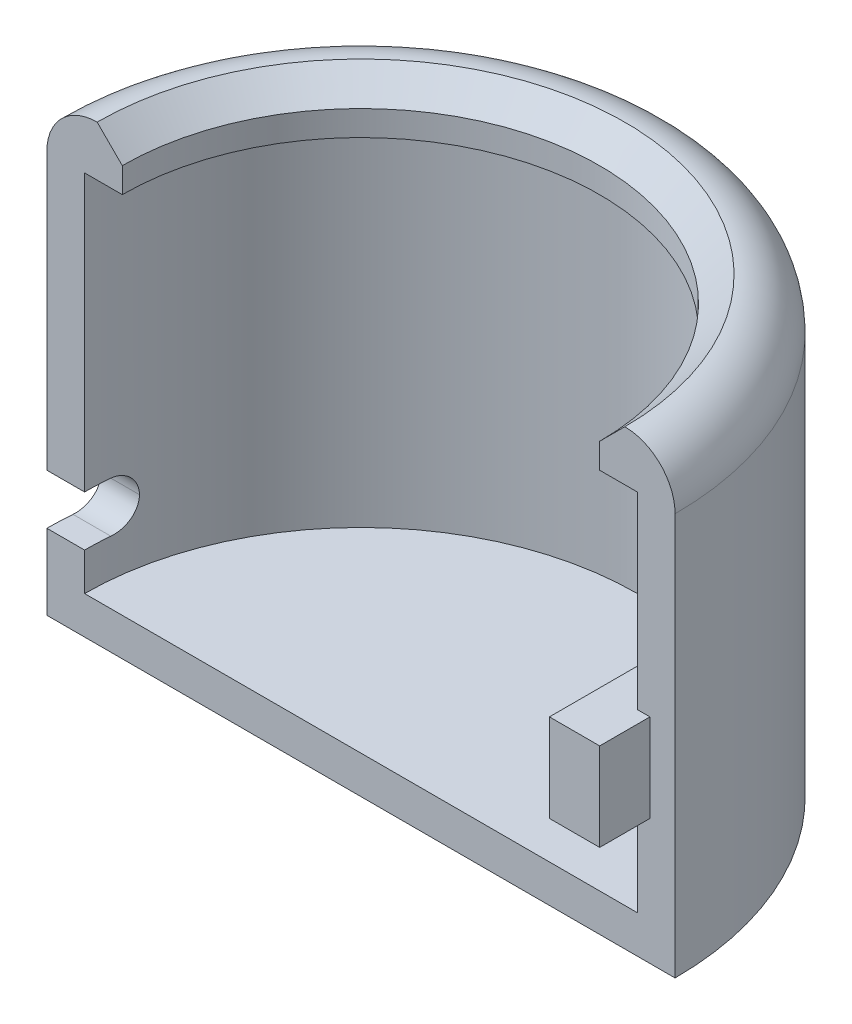
ISO-10303-21;
HEADER;
FILE_DESCRIPTION(('STEP AP214'),'2;1');
FILE_NAME('part.step','',(''),(''),'','','');
FILE_SCHEMA(('AUTOMOTIVE_DESIGN { 1 0 10303 214 1 1 1 1 }'));
ENDSEC;
DATA;
#1=APPLICATION_CONTEXT('core data for automotive mechanical design processes');
#2=APPLICATION_PROTOCOL_DEFINITION('international standard','automotive_design',2000,#1);
#3=PRODUCT_CONTEXT('',#1,'mechanical');
#4=PRODUCT('Part','Part','',(#3));
#5=PRODUCT_RELATED_PRODUCT_CATEGORY('part','',(#4));
#6=PRODUCT_DEFINITION_FORMATION('','',#4);
#7=PRODUCT_DEFINITION_CONTEXT('part definition',#1,'design');
#8=PRODUCT_DEFINITION('design','',#6,#7);
#9=PRODUCT_DEFINITION_SHAPE('','',#8);
#10=(LENGTH_UNIT() NAMED_UNIT(*) SI_UNIT(.MILLI.,.METRE.));
#11=(NAMED_UNIT(*) PLANE_ANGLE_UNIT() SI_UNIT($,.RADIAN.));
#12=(NAMED_UNIT(*) SI_UNIT($,.STERADIAN.) SOLID_ANGLE_UNIT());
#13=UNCERTAINTY_MEASURE_WITH_UNIT(LENGTH_MEASURE(1.E-05),#10,'distance_accuracy_value','');
#14=(GEOMETRIC_REPRESENTATION_CONTEXT(3) GLOBAL_UNCERTAINTY_ASSIGNED_CONTEXT((#13)) GLOBAL_UNIT_ASSIGNED_CONTEXT((#10,
#11,#12)) REPRESENTATION_CONTEXT('',''));
#15=CARTESIAN_POINT('',(0.,0.,0.));
#16=DIRECTION('',(0.,0.,1.));
#17=DIRECTION('',(1.,0.,0.));
#18=AXIS2_PLACEMENT_3D('',#15,#16,#17);
#19=CARTESIAN_POINT('',(0.,0.,0.));
#20=DIRECTION('',(0.,-1.,0.));
#21=DIRECTION('',(0.,0.,-1.));
#22=AXIS2_PLACEMENT_3D('',#19,#20,#21);
#23=CYLINDRICAL_SURFACE('',#22,11.);
#24=DIRECTION('',(0.,-1.,0.));
#25=VECTOR('',#24,1.);
#26=CARTESIAN_POINT('',(11.,16.,0.));
#27=LINE('',#26,#25);
#28=CARTESIAN_POINT('',(11.,5.,0.));
#29=VERTEX_POINT('',#28);
#30=CARTESIAN_POINT('',(11.,1.5,0.));
#31=VERTEX_POINT('',#30);
#32=EDGE_CURVE('E228',#29,#31,#27,.T.);
#33=ORIENTED_EDGE('',*,*,#32,.F.);
#34=CARTESIAN_POINT('',(0.,5.,0.));
#35=DIRECTION('',(0.,-1.,0.));
#36=DIRECTION('',(0.,0.,-1.));
#37=AXIS2_PLACEMENT_3D('',#34,#35,#36);
#38=CIRCLE('',#37,11.);
#39=CARTESIAN_POINT('',(9.5,5.,-5.54526825320471));
#40=VERTEX_POINT('',#39);
#41=EDGE_CURVE('E59',#29,#40,#38,.F.);
#42=ORIENTED_EDGE('',*,*,#41,.T.);
#43=DIRECTION('',(0.,-1.,0.));
#44=VECTOR('',#43,1.);
#45=CARTESIAN_POINT('',(9.5,0.,-5.54526825320471));
#46=LINE('',#45,#44);
#47=CARTESIAN_POINT('',(9.5,8.5,-5.54526825320471));
#48=VERTEX_POINT('',#47);
#49=EDGE_CURVE('E64',#40,#48,#46,.F.);
#50=ORIENTED_EDGE('',*,*,#49,.T.);
#51=CARTESIAN_POINT('',(0.,8.5,0.));
#52=DIRECTION('',(0.,1.,0.));
#53=DIRECTION('',(0.,0.,1.));
#54=AXIS2_PLACEMENT_3D('',#51,#52,#53);
#55=CIRCLE('',#54,11.);
#56=CARTESIAN_POINT('',(11.,8.5,0.));
#57=VERTEX_POINT('',#56);
#58=EDGE_CURVE('E387',#48,#57,#55,.F.);
#59=ORIENTED_EDGE('',*,*,#58,.T.);
#60=CARTESIAN_POINT('',(11.,16.,0.));
#61=VERTEX_POINT('',#60);
#62=EDGE_CURVE('E229',#61,#57,#27,.T.);
#63=ORIENTED_EDGE('',*,*,#62,.F.);
#64=CARTESIAN_POINT('',(0.,16.,0.));
#65=DIRECTION('',(0.,-1.,0.));
#66=DIRECTION('',(0.,0.,-1.));
#67=AXIS2_PLACEMENT_3D('',#64,#65,#66);
#68=CIRCLE('',#67,11.);
#69=CARTESIAN_POINT('',(-11.,16.,0.));
#70=VERTEX_POINT('',#69);
#71=EDGE_CURVE('E261',#70,#61,#68,.T.);
#72=ORIENTED_EDGE('',*,*,#71,.F.);
#73=DIRECTION('',(0.,-1.,0.));
#74=VECTOR('',#73,1.);
#75=CARTESIAN_POINT('',(-11.,16.,0.));
#76=LINE('',#75,#74);
#77=CARTESIAN_POINT('',(-11.,5.,0.));
#78=VERTEX_POINT('',#77);
#79=EDGE_CURVE('E249',#70,#78,#76,.T.);
#80=ORIENTED_EDGE('',*,*,#79,.T.);
#81=CARTESIAN_POINT('',(0.,5.,0.));
#82=DIRECTION('',(0.,1.,0.));
#83=DIRECTION('',(0.,0.,1.));
#84=AXIS2_PLACEMENT_3D('',#81,#82,#83);
#85=CIRCLE('',#84,11.);
#86=CARTESIAN_POINT('',(-10.9544511501033,5.,-1.));
#87=VERTEX_POINT('',#86);
#88=EDGE_CURVE('E199',#78,#87,#85,.F.);
#89=ORIENTED_EDGE('',*,*,#88,.T.);
#90=CARTESIAN_POINT('',(-10.9544511501033,5.,-1.));
#91=CARTESIAN_POINT('',(-10.9518675809151,4.9999998199935,-1.02830839869906));
#92=CARTESIAN_POINT('',(-10.9491741852321,4.99879723433273,-1.0565926700534));
#93=CARTESIAN_POINT('',(-10.9435904837359,4.99400481074643,-1.11293611508523));
#94=CARTESIAN_POINT('',(-10.9407001956144,4.9904151870564,-1.14099530873464));
#95=CARTESIAN_POINT('',(-10.931778195905,4.97610912130699,-1.2244764232659));
#96=CARTESIAN_POINT('',(-10.9254857941944,4.9618553414229,-1.27930602995323));
#97=CARTESIAN_POINT('',(-10.9124996642088,4.92434018108407,-1.38572513755939));
#98=CARTESIAN_POINT('',(-10.9058058227038,4.90107624903445,-1.43731371583379));
#99=CARTESIAN_POINT('',(-10.8923676977008,4.84620040831363,-1.53583801077365));
#100=CARTESIAN_POINT('',(-10.8856234176689,4.81458906821104,-1.58277404403944));
#101=CARTESIAN_POINT('',(-10.872454094253,4.74375276313902,-1.67084902051204));
#102=CARTESIAN_POINT('',(-10.8660303586156,4.70449937740766,-1.71196530253926));
#103=CARTESIAN_POINT('',(-10.8539397225827,4.61952570109758,-1.78702021815186));
#104=CARTESIAN_POINT('',(-10.8482729426689,4.57380438342226,-1.82095770961758));
#105=CARTESIAN_POINT('',(-10.8381124738057,4.47742748619328,-1.88048627289487));
#106=CARTESIAN_POINT('',(-10.8336129715715,4.42679815366631,-1.9061188703052));
#107=CARTESIAN_POINT('',(-10.8260756758648,4.32185700115901,-1.9484742029149));
#108=CARTESIAN_POINT('',(-10.8230367471214,4.2675480788292,-1.96520385925963));
#109=CARTESIAN_POINT('',(-10.81945781636,4.17737900302397,-1.98478988213805));
#110=CARTESIAN_POINT('',(-10.8184092027135,4.1421310142209,-1.99048930336897));
#111=CARTESIAN_POINT('',(-10.8170062697717,4.07126090112556,-1.99809408407323));
#112=CARTESIAN_POINT('',(-10.8166510526255,4.03563932078584,-2.00000435002126));
#113=CARTESIAN_POINT('',(-10.816653826392,4.,-2.));
#114=B_SPLINE_CURVE_WITH_KNOTS('',3,(#90,#91,#92,#93,#94,#95,#96,#97,#98,#99,#100,#101,#102,
#103,#104,#105,#106,#107,#108,#109,#110,#111,#112,#113),.UNSPECIFIED.,.F.,.F.,(4,2,2,2,2,2,2,2,
2,2,2,4),(0.,0.0852248659012835,0.17044208394473,0.340566766933351,0.510739662986263,
0.680900971008499,0.851707633267387,1.02254144984461,1.19250739665715,1.36234101822398,
1.46931029164489,1.57614096279052),.UNSPECIFIED.);
#115=CARTESIAN_POINT('',(-10.816653826392,4.,-2.));
#116=VERTEX_POINT('',#115);
#117=EDGE_CURVE('E303',#87,#116,#114,.T.);
#118=ORIENTED_EDGE('',*,*,#117,.T.);
#119=CARTESIAN_POINT('',(-10.816653826392,4.,-2.));
#120=CARTESIAN_POINT('',(-10.8166531832004,3.9721570117737,-2.00000007570774));
#121=CARTESIAN_POINT('',(-10.8168690435344,3.94432753902859,-1.99883640879706));
#122=CARTESIAN_POINT('',(-10.8177257927322,3.88887141558756,-1.99419580647937));
#123=CARTESIAN_POINT('',(-10.8183666407221,3.86124474564511,-1.99071909353292));
#124=CARTESIAN_POINT('',(-10.8209109706457,3.77904707553457,-1.9768610305933));
#125=CARTESIAN_POINT('',(-10.823436310885,3.72503253307554,-1.96305160794933));
#126=CARTESIAN_POINT('',(-10.8299643008146,3.62013716143522,-1.92670956043359));
#127=CARTESIAN_POINT('',(-10.8339673178462,3.56925711514355,-1.90417476641987));
#128=CARTESIAN_POINT('',(-10.8431697198825,3.47200510226195,-1.85105224574431));
#129=CARTESIAN_POINT('',(-10.8483691232962,3.42563320505515,-1.82046439516792));
#130=CARTESIAN_POINT('',(-10.8596696193382,3.33824654516375,-1.75179735112358));
#131=CARTESIAN_POINT('',(-10.8657785276165,3.29728468648399,-1.7136521684561));
#132=CARTESIAN_POINT('',(-10.8784749534925,3.22230588948367,-1.63111098440458));
#133=CARTESIAN_POINT('',(-10.8850625858119,3.1882906233389,-1.5867134823048));
#134=CARTESIAN_POINT('',(-10.8984139674121,3.12772849810608,-1.49227167189927));
#135=CARTESIAN_POINT('',(-10.9051788935598,3.10128597728028,-1.44216065334069));
#136=CARTESIAN_POINT('',(-10.918425731274,3.05722763815222,-1.338177670493));
#137=CARTESIAN_POINT('',(-10.9249078027614,3.03960677164119,-1.28430787732711));
#138=CARTESIAN_POINT('',(-10.9353115438696,3.01780763132853,-1.19180120168974));
#139=CARTESIAN_POINT('',(-10.9393933415288,3.01113855027786,-1.15375054794585));
#140=CARTESIAN_POINT('',(-10.9472030857999,3.00223439580666,-1.07714541315814));
#141=CARTESIAN_POINT('',(-10.9509314519239,2.99999400130974,-1.0385915928299));
#142=CARTESIAN_POINT('',(-10.9544511501033,3.,-1.));
#143=B_SPLINE_CURVE_WITH_KNOTS('',3,(#119,#120,#121,#122,#123,#124,#125,#126,#127,#128,#129,
#130,#131,#132,#133,#134,#135,#136,#137,#138,#139,#140,#141,#142),.UNSPECIFIED.,.F.,.F.,(4,2,2,
2,2,2,2,2,2,2,2,4),(0.,0.08347707527952,0.166946123190975,0.333511431406912,0.50011817465156,
0.666727481668638,0.834861367282832,1.00303567831007,1.1734264419907,1.34371958745275,
1.46001415118683,1.57616890161781),.UNSPECIFIED.);
#144=CARTESIAN_POINT('',(-10.9544511501033,3.,-1.));
#145=VERTEX_POINT('',#144);
#146=EDGE_CURVE('E52',#116,#145,#143,.T.);
#147=ORIENTED_EDGE('',*,*,#146,.T.);
#148=CARTESIAN_POINT('',(0.,3.,0.));
#149=DIRECTION('',(0.,-1.,0.));
#150=DIRECTION('',(0.,0.,-1.));
#151=AXIS2_PLACEMENT_3D('',#148,#149,#150);
#152=CIRCLE('',#151,11.);
#153=CARTESIAN_POINT('',(-11.,3.,0.));
#154=VERTEX_POINT('',#153);
#155=EDGE_CURVE('E210',#145,#154,#152,.F.);
#156=ORIENTED_EDGE('',*,*,#155,.T.);
#157=CARTESIAN_POINT('',(-11.,1.5,0.));
#158=VERTEX_POINT('',#157);
#159=EDGE_CURVE('E248',#154,#158,#76,.T.);
#160=ORIENTED_EDGE('',*,*,#159,.T.);
#161=CARTESIAN_POINT('',(0.,1.5,0.));
#162=DIRECTION('',(0.,-1.,0.));
#163=DIRECTION('',(0.,0.,-1.));
#164=AXIS2_PLACEMENT_3D('',#161,#162,#163);
#165=CIRCLE('',#164,11.);
#166=EDGE_CURVE('E257',#158,#31,#165,.T.);
#167=ORIENTED_EDGE('',*,*,#166,.T.);
#168=EDGE_LOOP('',(#33,#42,#50,#59,#63,#72,#80,#89,#118,#147,#156,#160,#167));
#169=FACE_BOUND('',#168,.T.);
#170=ADVANCED_FACE('F41',(#169),#23,.F.);
#171=CARTESIAN_POINT('',(0.,0.,0.));
#172=DIRECTION('',(0.,0.,-1.));
#173=DIRECTION('',(-1.,0.,0.));
#174=AXIS2_PLACEMENT_3D('',#171,#172,#173);
#175=PLANE('',#174);
#176=DIRECTION('',(1.,0.,0.));
#177=VECTOR('',#176,1.);
#178=CARTESIAN_POINT('',(9.5,5.,0.));
#179=LINE('',#178,#177);
#180=CARTESIAN_POINT('',(11.5,5.,0.));
#181=VERTEX_POINT('',#180);
#182=EDGE_CURVE('E400',#29,#181,#179,.T.);
#183=ORIENTED_EDGE('',*,*,#182,.F.);
#184=ORIENTED_EDGE('',*,*,#32,.T.);
#185=DIRECTION('',(1.,0.,0.));
#186=VECTOR('',#185,1.);
#187=CARTESIAN_POINT('',(-11.,1.5,0.));
#188=LINE('',#187,#186);
#189=EDGE_CURVE('E253',#158,#31,#188,.T.);
#190=ORIENTED_EDGE('',*,*,#189,.F.);
#191=ORIENTED_EDGE('',*,*,#159,.F.);
#192=DIRECTION('',(1.,0.,0.));
#193=VECTOR('',#192,1.);
#194=CARTESIAN_POINT('',(-12.501,3.,0.));
#195=LINE('',#194,#193);
#196=CARTESIAN_POINT('',(-12.5,3.,0.));
#197=VERTEX_POINT('',#196);
#198=EDGE_CURVE('E206',#197,#154,#195,.T.);
#199=ORIENTED_EDGE('',*,*,#198,.F.);
#200=DIRECTION('',(0.,1.,0.));
#201=VECTOR('',#200,1.);
#202=CARTESIAN_POINT('',(-12.5,0.,0.));
#203=LINE('',#202,#201);
#204=CARTESIAN_POINT('',(-12.5,0.,0.));
#205=VERTEX_POINT('',#204);
#206=EDGE_CURVE('E237',#205,#197,#203,.T.);
#207=ORIENTED_EDGE('',*,*,#206,.F.);
#208=DIRECTION('',(-1.,0.,0.));
#209=VECTOR('',#208,1.);
#210=CARTESIAN_POINT('',(0.,0.,0.));
#211=LINE('',#210,#209);
#212=CARTESIAN_POINT('',(12.5,0.,0.));
#213=VERTEX_POINT('',#212);
#214=EDGE_CURVE('E232',#213,#205,#211,.T.);
#215=ORIENTED_EDGE('',*,*,#214,.F.);
#216=DIRECTION('',(0.,1.,0.));
#217=VECTOR('',#216,1.);
#218=CARTESIAN_POINT('',(12.5,0.,0.));
#219=LINE('',#218,#217);
#220=CARTESIAN_POINT('',(12.5,16.,0.));
#221=VERTEX_POINT('',#220);
#222=EDGE_CURVE('E217',#213,#221,#219,.T.);
#223=ORIENTED_EDGE('',*,*,#222,.T.);
#224=CARTESIAN_POINT('',(10.5,16.,0.));
#225=DIRECTION('',(0.,0.,-1.));
#226=DIRECTION('',(-1.,0.,0.));
#227=AXIS2_PLACEMENT_3D('',#224,#225,#226);
#228=CIRCLE('',#227,2.);
#229=CARTESIAN_POINT('',(10.5,18.,0.));
#230=VERTEX_POINT('',#229);
#231=EDGE_CURVE('E293',#221,#230,#228,.F.);
#232=ORIENTED_EDGE('',*,*,#231,.T.);
#233=DIRECTION('',(-0.707106781186545,-0.70710678118655,0.));
#234=VECTOR('',#233,1.);
#235=CARTESIAN_POINT('',(0.,7.49999999999992,0.));
#236=LINE('',#235,#234);
#237=CARTESIAN_POINT('',(9.5,17.,0.));
#238=VERTEX_POINT('',#237);
#239=EDGE_CURVE('E279',#230,#238,#236,.T.);
#240=ORIENTED_EDGE('',*,*,#239,.T.);
#241=DIRECTION('',(0.,-1.,0.));
#242=VECTOR('',#241,1.);
#243=CARTESIAN_POINT('',(9.5,18.,0.));
#244=LINE('',#243,#242);
#245=CARTESIAN_POINT('',(9.5,16.,0.));
#246=VERTEX_POINT('',#245);
#247=EDGE_CURVE('E221',#238,#246,#244,.T.);
#248=ORIENTED_EDGE('',*,*,#247,.T.);
#249=DIRECTION('',(1.,0.,0.));
#250=VECTOR('',#249,1.);
#251=CARTESIAN_POINT('',(9.5,16.,0.));
#252=LINE('',#251,#250);
#253=EDGE_CURVE('E224',#246,#61,#252,.T.);
#254=ORIENTED_EDGE('',*,*,#253,.T.);
#255=ORIENTED_EDGE('',*,*,#62,.T.);
#256=DIRECTION('',(-1.,0.,0.));
#257=VECTOR('',#256,1.);
#258=CARTESIAN_POINT('',(9.5,8.5,0.));
#259=LINE('',#258,#257);
#260=CARTESIAN_POINT('',(11.5,8.5,0.));
#261=VERTEX_POINT('',#260);
#262=EDGE_CURVE('E183',#261,#57,#259,.T.);
#263=ORIENTED_EDGE('',*,*,#262,.F.);
#264=DIRECTION('',(0.,1.,0.));
#265=VECTOR('',#264,1.);
#266=CARTESIAN_POINT('',(11.5,8.5,0.));
#267=LINE('',#266,#265);
#268=EDGE_CURVE('E397',#181,#261,#267,.T.);
#269=ORIENTED_EDGE('',*,*,#268,.F.);
#270=EDGE_LOOP('',(#183,#184,#190,#191,#199,#207,#215,#223,#232,#240,#248,#254,#255,#263,#269));
#271=FACE_BOUND('',#270,.T.);
#272=ADVANCED_FACE('F325',(#271),#175,.F.);
#273=CARTESIAN_POINT('',(-12.5,5.,0.));
#274=VERTEX_POINT('',#273);
#275=CARTESIAN_POINT('',(-12.5,16.,0.));
#276=VERTEX_POINT('',#275);
#277=EDGE_CURVE('E236',#274,#276,#203,.T.);
#278=ORIENTED_EDGE('',*,*,#277,.F.);
#279=DIRECTION('',(-1.,0.,0.));
#280=VECTOR('',#279,1.);
#281=CARTESIAN_POINT('',(-12.501,5.,0.));
#282=LINE('',#281,#280);
#283=EDGE_CURVE('E191',#78,#274,#282,.T.);
#284=ORIENTED_EDGE('',*,*,#283,.F.);
#285=ORIENTED_EDGE('',*,*,#79,.F.);
#286=DIRECTION('',(-1.,0.,0.));
#287=VECTOR('',#286,1.);
#288=CARTESIAN_POINT('',(-9.5,16.,0.));
#289=LINE('',#288,#287);
#290=CARTESIAN_POINT('',(-9.5,16.,0.));
#291=VERTEX_POINT('',#290);
#292=EDGE_CURVE('E244',#291,#70,#289,.T.);
#293=ORIENTED_EDGE('',*,*,#292,.F.);
#294=DIRECTION('',(0.,-1.,0.));
#295=VECTOR('',#294,1.);
#296=CARTESIAN_POINT('',(-9.5,18.,0.));
#297=LINE('',#296,#295);
#298=CARTESIAN_POINT('',(-9.5,17.,0.));
#299=VERTEX_POINT('',#298);
#300=EDGE_CURVE('E241',#299,#291,#297,.T.);
#301=ORIENTED_EDGE('',*,*,#300,.F.);
#302=DIRECTION('',(-0.707106781186545,0.70710678118655,0.));
#303=VECTOR('',#302,1.);
#304=CARTESIAN_POINT('',(0.,7.49999999999992,0.));
#305=LINE('',#304,#303);
#306=CARTESIAN_POINT('',(-10.5,18.,0.));
#307=VERTEX_POINT('',#306);
#308=EDGE_CURVE('E276',#299,#307,#305,.T.);
#309=ORIENTED_EDGE('',*,*,#308,.T.);
#310=CARTESIAN_POINT('',(-10.5,16.,0.));
#311=DIRECTION('',(0.,0.,-1.));
#312=DIRECTION('',(-1.,0.,0.));
#313=AXIS2_PLACEMENT_3D('',#310,#311,#312);
#314=CIRCLE('',#313,2.);
#315=EDGE_CURVE('E289',#307,#276,#314,.F.);
#316=ORIENTED_EDGE('',*,*,#315,.T.);
#317=EDGE_LOOP('',(#278,#284,#285,#293,#301,#309,#316));
#318=FACE_BOUND('',#317,.T.);
#319=ADVANCED_FACE('F350',(#318),#175,.F.);
#320=CARTESIAN_POINT('',(0.,0.,0.));
#321=DIRECTION('',(0.,-1.,0.));
#322=DIRECTION('',(0.,0.,-1.));
#323=AXIS2_PLACEMENT_3D('',#320,#321,#322);
#324=PLANE('',#323);
#325=CARTESIAN_POINT('',(0.,0.,0.));
#326=DIRECTION('',(0.,-1.,0.));
#327=DIRECTION('',(0.,0.,-1.));
#328=AXIS2_PLACEMENT_3D('',#325,#326,#327);
#329=CIRCLE('',#328,12.5);
#330=EDGE_CURVE('E268',#205,#213,#329,.T.);
#331=ORIENTED_EDGE('',*,*,#330,.T.);
#332=ORIENTED_EDGE('',*,*,#214,.T.);
#333=EDGE_LOOP('',(#331,#332));
#334=FACE_BOUND('',#333,.T.);
#335=ADVANCED_FACE('F345',(#334),#324,.T.);
#336=CARTESIAN_POINT('',(0.,0.,0.));
#337=DIRECTION('',(0.,-1.,0.));
#338=DIRECTION('',(0.,0.,-1.));
#339=AXIS2_PLACEMENT_3D('',#336,#337,#338);
#340=CYLINDRICAL_SURFACE('',#339,12.5);
#341=CARTESIAN_POINT('',(0.,3.,0.));
#342=DIRECTION('',(0.,-1.,0.));
#343=DIRECTION('',(0.,0.,-1.));
#344=AXIS2_PLACEMENT_3D('',#341,#342,#343);
#345=CIRCLE('',#344,12.5);
#346=CARTESIAN_POINT('',(-12.4599357943771,3.,-1.));
#347=VERTEX_POINT('',#346);
#348=EDGE_CURVE('E213',#197,#347,#345,.T.);
#349=ORIENTED_EDGE('',*,*,#348,.T.);
#350=CARTESIAN_POINT('',(-12.4599357943771,3.,-1.));
#351=CARTESIAN_POINT('',(-12.4576675349942,3.00000018161219,-1.0282691453316));
#352=CARTESIAN_POINT('',(-12.4553029808142,3.0011994407034,-1.05651660374712));
#353=CARTESIAN_POINT('',(-12.450401198586,3.00597978592114,-1.11279188711486));
#354=CARTESIAN_POINT('',(-12.4478639844011,3.0095606810219,-1.14081972949958));
#355=CARTESIAN_POINT('',(-12.4400319452468,3.02383468103815,-1.22421731767831));
#356=CARTESIAN_POINT('',(-12.4345085160692,3.03805923170597,-1.27900288979199));
#357=CARTESIAN_POINT('',(-12.4231099874704,3.07550795639682,-1.38535488246229));
#358=CARTESIAN_POINT('',(-12.4172347731823,3.09873508369665,-1.43692024018204));
#359=CARTESIAN_POINT('',(-12.4054416865245,3.15352970341988,-1.53540770143641));
#360=CARTESIAN_POINT('',(-12.3995238181771,3.18509641916666,-1.58233023680401));
#361=CARTESIAN_POINT('',(-12.38797519854,3.25579928955282,-1.67034443770372));
#362=CARTESIAN_POINT('',(-12.382345332118,3.29495718658347,-1.71141875241152));
#363=CARTESIAN_POINT('',(-12.3717492576507,3.37970846205583,-1.78640929408559));
#364=CARTESIAN_POINT('',(-12.3667831607244,3.42530291539569,-1.82032432309326));
#365=CARTESIAN_POINT('',(-12.3578712729345,3.521450783233,-1.87987339087707));
#366=CARTESIAN_POINT('',(-12.3539215890163,3.57198422170001,-1.90553912305964));
#367=CARTESIAN_POINT('',(-12.3473002246243,3.67671571022889,-1.94798406667593));
#368=CARTESIAN_POINT('',(-12.3446276085969,3.73091104433685,-1.96476978439383));
#369=CARTESIAN_POINT('',(-12.341459590856,3.82123198175614,-1.9845490815631));
#370=CARTESIAN_POINT('',(-12.3405257966586,3.85675454154386,-1.99033894128202));
#371=CARTESIAN_POINT('',(-12.339276502468,3.92817927723038,-1.99806407016412));
#372=CARTESIAN_POINT('',(-12.3389601855208,3.96408088827074,-2.00000443246536));
#373=CARTESIAN_POINT('',(-12.3389626792531,4.,-2.));
#374=B_SPLINE_CURVE_WITH_KNOTS('',3,(#350,#351,#352,#353,#354,#355,#356,#357,#358,#359,#360,
#361,#362,#363,#364,#365,#366,#367,#368,#369,#370,#371,#372,#373),.UNSPECIFIED.,.F.,.F.,(4,2,2,
2,2,2,2,2,2,2,2,4),(0.,0.0850270461925778,0.170047273375565,0.339785355547896,0.509579167142608,
0.679357171191921,0.849628830043628,1.01992895779552,1.1895667548476,1.35908008749453,
1.46689246525141,1.57456210476592),.UNSPECIFIED.);
#375=CARTESIAN_POINT('',(-12.3389626792531,4.,-2.));
#376=VERTEX_POINT('',#375);
#377=EDGE_CURVE('E11',#347,#376,#374,.T.);
#378=ORIENTED_EDGE('',*,*,#377,.T.);
#379=CARTESIAN_POINT('',(-12.3389626792531,4.,-2.));
#380=CARTESIAN_POINT('',(-12.338962124352,4.02790910208154,-2.00000001669787));
#381=CARTESIAN_POINT('',(-12.3391522408202,4.05580469787176,-1.99883087936032));
#382=CARTESIAN_POINT('',(-12.33990688728,4.11139343550084,-1.99416806295667));
#383=CARTESIAN_POINT('',(-12.3404713853947,4.13908659437334,-1.99067458179791));
#384=CARTESIAN_POINT('',(-12.342712964042,4.22149080894834,-1.97674751176261));
#385=CARTESIAN_POINT('',(-12.3449381879035,4.27564537169421,-1.96286716109418));
#386=CARTESIAN_POINT('',(-12.3506922976683,4.38081759754929,-1.92632747500718));
#387=CARTESIAN_POINT('',(-12.3542215764002,4.43183431001706,-1.90366549414298));
#388=CARTESIAN_POINT('',(-12.3623369883969,4.52933682107776,-1.8502301860131));
#389=CARTESIAN_POINT('',(-12.3669230927026,4.57582274377318,-1.81945708100411));
#390=CARTESIAN_POINT('',(-12.3768817483819,4.6633069131724,-1.75043395322155));
#391=CARTESIAN_POINT('',(-12.382259640494,4.70426395499471,-1.71213251125336));
#392=CARTESIAN_POINT('',(-12.3934359790346,4.77919991902776,-1.6292603970599));
#393=CARTESIAN_POINT('',(-12.399234522086,4.81317723109328,-1.58468828224751));
#394=CARTESIAN_POINT('',(-12.4109668273048,4.87352817609243,-1.49003271134045));
#395=CARTESIAN_POINT('',(-12.4169013655219,4.89982066976245,-1.43989765092555));
#396=CARTESIAN_POINT('',(-12.4285195089563,4.94358256806112,-1.33590161889852));
#397=CARTESIAN_POINT('',(-12.4342032567229,4.96105704538064,-1.28204280975));
#398=CARTESIAN_POINT('',(-12.4432917368459,4.98254494758887,-1.18991162901449));
#399=CARTESIAN_POINT('',(-12.4468396897928,4.9890830753873,-1.1522227934268));
#400=CARTESIAN_POINT('',(-12.4536299878427,4.9978107257295,-1.07636640058036));
#401=CARTESIAN_POINT('',(-12.4568727105063,5.0000056897917,-1.03819950272607));
#402=CARTESIAN_POINT('',(-12.4599357943771,5.,-1.));
#403=B_SPLINE_CURVE_WITH_KNOTS('',3,(#379,#380,#381,#382,#383,#384,#385,#386,#387,#388,#389,
#390,#391,#392,#393,#394,#395,#396,#397,#398,#399,#400,#401,#402),.UNSPECIFIED.,.F.,.F.,(4,2,2,
2,2,2,2,2,2,2,2,4),(0.,0.0836754297957571,0.167343735919475,0.334328613499381,0.501363834039752,
0.668394478045735,0.836608295908811,1.00486087533885,1.17483057884335,1.34470239304411,
1.45971516814914,1.57458375310764),.UNSPECIFIED.);
#404=CARTESIAN_POINT('',(-12.4599357943771,5.,-1.));
#405=VERTEX_POINT('',#404);
#406=EDGE_CURVE('E311',#376,#405,#403,.T.);
#407=ORIENTED_EDGE('',*,*,#406,.T.);
#408=CARTESIAN_POINT('',(0.,5.,0.));
#409=DIRECTION('',(0.,1.,0.));
#410=DIRECTION('',(0.,0.,1.));
#411=AXIS2_PLACEMENT_3D('',#408,#409,#410);
#412=CIRCLE('',#411,12.5);
#413=EDGE_CURVE('E203',#405,#274,#412,.T.);
#414=ORIENTED_EDGE('',*,*,#413,.T.);
#415=ORIENTED_EDGE('',*,*,#277,.T.);
#416=CARTESIAN_POINT('',(0.,16.,0.));
#417=DIRECTION('',(0.,1.,0.));
#418=DIRECTION('',(0.,0.,1.));
#419=AXIS2_PLACEMENT_3D('',#416,#417,#418);
#420=CIRCLE('',#419,12.5);
#421=EDGE_CURVE('E285',#276,#221,#420,.F.);
#422=ORIENTED_EDGE('',*,*,#421,.T.);
#423=ORIENTED_EDGE('',*,*,#222,.F.);
#424=ORIENTED_EDGE('',*,*,#330,.F.);
#425=ORIENTED_EDGE('',*,*,#206,.T.);
#426=EDGE_LOOP('',(#349,#378,#407,#414,#415,#422,#423,#424,#425));
#427=FACE_BOUND('',#426,.T.);
#428=ADVANCED_FACE('F340',(#427),#340,.T.);
#429=CARTESIAN_POINT('',(0.,0.,0.));
#430=DIRECTION('',(0.,-1.,0.));
#431=DIRECTION('',(0.,0.,-1.));
#432=AXIS2_PLACEMENT_3D('',#429,#430,#431);
#433=CYLINDRICAL_SURFACE('',#432,9.5);
#434=ORIENTED_EDGE('',*,*,#247,.F.);
#435=CARTESIAN_POINT('',(0.,17.,0.));
#436=DIRECTION('',(0.,1.,0.));
#437=DIRECTION('',(0.,0.,1.));
#438=AXIS2_PLACEMENT_3D('',#435,#436,#437);
#439=CIRCLE('',#438,9.5);
#440=EDGE_CURVE('E282',#238,#299,#439,.T.);
#441=ORIENTED_EDGE('',*,*,#440,.T.);
#442=ORIENTED_EDGE('',*,*,#300,.T.);
#443=CARTESIAN_POINT('',(0.,16.,0.));
#444=DIRECTION('',(0.,-1.,0.));
#445=DIRECTION('',(0.,0.,-1.));
#446=AXIS2_PLACEMENT_3D('',#443,#444,#445);
#447=CIRCLE('',#446,9.5);
#448=EDGE_CURVE('E264',#291,#246,#447,.T.);
#449=ORIENTED_EDGE('',*,*,#448,.T.);
#450=EDGE_LOOP('',(#434,#441,#442,#449));
#451=FACE_BOUND('',#450,.T.);
#452=ADVANCED_FACE('F344',(#451),#433,.F.);
#453=CARTESIAN_POINT('',(-9.5,16.,0.));
#454=DIRECTION('',(0.,-1.,0.));
#455=DIRECTION('',(0.,0.,-1.));
#456=AXIS2_PLACEMENT_3D('',#453,#454,#455);
#457=PLANE('',#456);
#458=ORIENTED_EDGE('',*,*,#71,.T.);
#459=ORIENTED_EDGE('',*,*,#253,.F.);
#460=ORIENTED_EDGE('',*,*,#448,.F.);
#461=ORIENTED_EDGE('',*,*,#292,.T.);
#462=EDGE_LOOP('',(#458,#459,#460,#461));
#463=FACE_BOUND('',#462,.T.);
#464=ADVANCED_FACE('F328',(#463),#457,.T.);
#465=CARTESIAN_POINT('',(-11.,1.5,0.));
#466=DIRECTION('',(0.,1.,0.));
#467=DIRECTION('',(0.,0.,1.));
#468=AXIS2_PLACEMENT_3D('',#465,#466,#467);
#469=PLANE('',#468);
#470=ORIENTED_EDGE('',*,*,#189,.T.);
#471=ORIENTED_EDGE('',*,*,#166,.F.);
#472=EDGE_LOOP('',(#470,#471));
#473=FACE_BOUND('',#472,.T.);
#474=ADVANCED_FACE('F326',(#473),#469,.T.);
#475=CARTESIAN_POINT('',(0.,18.,0.));
#476=DIRECTION('',(0.,1.,0.));
#477=DIRECTION('',(0.,0.,1.));
#478=AXIS2_PLACEMENT_3D('',#475,#476,#477);
#479=CONICAL_SURFACE('',#478,10.5,0.785398163397445);
#480=ORIENTED_EDGE('',*,*,#308,.F.);
#481=ORIENTED_EDGE('',*,*,#440,.F.);
#482=ORIENTED_EDGE('',*,*,#239,.F.);
#483=CARTESIAN_POINT('',(0.,18.,0.));
#484=DIRECTION('',(0.,1.,0.));
#485=DIRECTION('',(0.,0.,1.));
#486=AXIS2_PLACEMENT_3D('',#483,#484,#485);
#487=CIRCLE('',#486,10.5);
#488=EDGE_CURVE('E272',#307,#230,#487,.F.);
#489=ORIENTED_EDGE('',*,*,#488,.F.);
#490=EDGE_LOOP('',(#480,#481,#482,#489));
#491=FACE_BOUND('',#490,.T.);
#492=ADVANCED_FACE('F353',(#491),#479,.F.);
#493=CARTESIAN_POINT('',(0.,16.,0.));
#494=DIRECTION('',(0.,1.,0.));
#495=DIRECTION('',(0.,0.,1.));
#496=AXIS2_PLACEMENT_3D('',#493,#494,#495);
#497=TOROIDAL_SURFACE('',#496,10.5,2.);
#498=ORIENTED_EDGE('',*,*,#315,.F.);
#499=ORIENTED_EDGE('',*,*,#488,.T.);
#500=ORIENTED_EDGE('',*,*,#231,.F.);
#501=ORIENTED_EDGE('',*,*,#421,.F.);
#502=EDGE_LOOP('',(#498,#499,#500,#501));
#503=FACE_BOUND('',#502,.T.);
#504=ADVANCED_FACE('F357',(#503),#497,.T.);
#505=CARTESIAN_POINT('',(-12.501,5.,2.));
#506=DIRECTION('',(0.,1.,0.));
#507=DIRECTION('',(0.,0.,1.));
#508=AXIS2_PLACEMENT_3D('',#505,#506,#507);
#509=PLANE('',#508);
#510=ORIENTED_EDGE('',*,*,#413,.F.);
#511=DIRECTION('',(1.,0.,0.));
#512=VECTOR('',#511,1.);
#513=CARTESIAN_POINT('',(-10.816653826392,5.,-1.));
#514=LINE('',#513,#512);
#515=EDGE_CURVE('E296',#405,#87,#514,.T.);
#516=ORIENTED_EDGE('',*,*,#515,.T.);
#517=ORIENTED_EDGE('',*,*,#88,.F.);
#518=ORIENTED_EDGE('',*,*,#283,.T.);
#519=EDGE_LOOP('',(#510,#516,#517,#518));
#520=FACE_BOUND('',#519,.T.);
#521=ADVANCED_FACE('F360',(#520),#509,.F.);
#522=CARTESIAN_POINT('',(-12.501,3.,2.));
#523=DIRECTION('',(0.,-1.,0.));
#524=DIRECTION('',(0.,0.,-1.));
#525=AXIS2_PLACEMENT_3D('',#522,#523,#524);
#526=PLANE('',#525);
#527=ORIENTED_EDGE('',*,*,#155,.F.);
#528=DIRECTION('',(1.,0.,0.));
#529=VECTOR('',#528,1.);
#530=CARTESIAN_POINT('',(-12.3389626792531,3.,-1.));
#531=LINE('',#530,#529);
#532=EDGE_CURVE('E300',#145,#347,#531,.F.);
#533=ORIENTED_EDGE('',*,*,#532,.T.);
#534=ORIENTED_EDGE('',*,*,#348,.F.);
#535=ORIENTED_EDGE('',*,*,#198,.T.);
#536=EDGE_LOOP('',(#527,#533,#534,#535));
#537=FACE_BOUND('',#536,.T.);
#538=ADVANCED_FACE('F365',(#537),#526,.F.);
#539=CARTESIAN_POINT('',(-12.501,4.,-1.));
#540=DIRECTION('',(-1.,0.,0.));
#541=DIRECTION('',(0.,0.,1.));
#542=AXIS2_PLACEMENT_3D('',#539,#540,#541);
#543=CYLINDRICAL_SURFACE('',#542,1.);
#544=DIRECTION('',(1.,0.,0.));
#545=VECTOR('',#544,1.);
#546=CARTESIAN_POINT('',(-10.816653826392,4.,-2.));
#547=LINE('',#546,#545);
#548=EDGE_CURVE('E46',#376,#116,#547,.T.);
#549=ORIENTED_EDGE('',*,*,#548,.F.);
#550=ORIENTED_EDGE('',*,*,#377,.F.);
#551=ORIENTED_EDGE('',*,*,#532,.F.);
#552=ORIENTED_EDGE('',*,*,#146,.F.);
#553=EDGE_LOOP('',(#549,#550,#551,#552));
#554=FACE_BOUND('',#553,.T.);
#555=ADVANCED_FACE('F43',(#554),#543,.F.);
#556=CARTESIAN_POINT('',(-12.501,4.,-1.));
#557=DIRECTION('',(-1.,0.,0.));
#558=DIRECTION('',(0.,0.,1.));
#559=AXIS2_PLACEMENT_3D('',#556,#557,#558);
#560=CYLINDRICAL_SURFACE('',#559,1.);
#561=ORIENTED_EDGE('',*,*,#406,.F.);
#562=ORIENTED_EDGE('',*,*,#548,.T.);
#563=ORIENTED_EDGE('',*,*,#117,.F.);
#564=ORIENTED_EDGE('',*,*,#515,.F.);
#565=EDGE_LOOP('',(#561,#562,#563,#564));
#566=FACE_BOUND('',#565,.T.);
#567=ADVANCED_FACE('F318',(#566),#560,.F.);
#568=CARTESIAN_POINT('',(9.5,8.5,2.));
#569=DIRECTION('',(1.,0.,0.));
#570=DIRECTION('',(0.,0.,-1.));
#571=AXIS2_PLACEMENT_3D('',#568,#569,#570);
#572=PLANE('',#571);
#573=DIRECTION('',(0.,0.,-1.));
#574=VECTOR('',#573,1.);
#575=CARTESIAN_POINT('',(9.5,8.5,2.));
#576=LINE('',#575,#574);
#577=CARTESIAN_POINT('',(9.5,8.5,2.));
#578=VERTEX_POINT('',#577);
#579=EDGE_CURVE('E404',#578,#48,#576,.T.);
#580=ORIENTED_EDGE('',*,*,#579,.T.);
#581=ORIENTED_EDGE('',*,*,#49,.F.);
#582=DIRECTION('',(0.,0.,-1.));
#583=VECTOR('',#582,1.);
#584=CARTESIAN_POINT('',(9.5,5.,2.));
#585=LINE('',#584,#583);
#586=CARTESIAN_POINT('',(9.5,5.,2.));
#587=VERTEX_POINT('',#586);
#588=EDGE_CURVE('E166',#587,#40,#585,.T.);
#589=ORIENTED_EDGE('',*,*,#588,.F.);
#590=DIRECTION('',(0.,-1.,0.));
#591=VECTOR('',#590,1.);
#592=CARTESIAN_POINT('',(9.5,8.5,2.));
#593=LINE('',#592,#591);
#594=EDGE_CURVE('E174',#578,#587,#593,.T.);
#595=ORIENTED_EDGE('',*,*,#594,.F.);
#596=EDGE_LOOP('',(#580,#581,#589,#595));
#597=FACE_BOUND('',#596,.T.);
#598=ADVANCED_FACE('F185',(#597),#572,.F.);
#599=CARTESIAN_POINT('',(9.5,5.,2.));
#600=DIRECTION('',(0.,1.,0.));
#601=DIRECTION('',(0.,0.,1.));
#602=AXIS2_PLACEMENT_3D('',#599,#600,#601);
#603=PLANE('',#602);
#604=ORIENTED_EDGE('',*,*,#588,.T.);
#605=ORIENTED_EDGE('',*,*,#41,.F.);
#606=ORIENTED_EDGE('',*,*,#182,.T.);
#607=DIRECTION('',(0.,0.,-1.));
#608=VECTOR('',#607,1.);
#609=CARTESIAN_POINT('',(11.5,5.,2.));
#610=LINE('',#609,#608);
#611=CARTESIAN_POINT('',(11.5,5.,2.));
#612=VERTEX_POINT('',#611);
#613=EDGE_CURVE('E169',#612,#181,#610,.T.);
#614=ORIENTED_EDGE('',*,*,#613,.F.);
#615=DIRECTION('',(1.,0.,0.));
#616=VECTOR('',#615,1.);
#617=CARTESIAN_POINT('',(9.5,5.,2.));
#618=LINE('',#617,#616);
#619=EDGE_CURVE('E162',#587,#612,#618,.T.);
#620=ORIENTED_EDGE('',*,*,#619,.F.);
#621=EDGE_LOOP('',(#604,#605,#606,#614,#620));
#622=FACE_BOUND('',#621,.T.);
#623=ADVANCED_FACE('F164',(#622),#603,.F.);
#624=CARTESIAN_POINT('',(11.5,8.5,2.));
#625=DIRECTION('',(-1.,0.,0.));
#626=DIRECTION('',(0.,0.,1.));
#627=AXIS2_PLACEMENT_3D('',#624,#625,#626);
#628=PLANE('',#627);
#629=ORIENTED_EDGE('',*,*,#268,.T.);
#630=DIRECTION('',(0.,0.,-1.));
#631=VECTOR('',#630,1.);
#632=CARTESIAN_POINT('',(11.5,8.5,2.));
#633=LINE('',#632,#631);
#634=CARTESIAN_POINT('',(11.5,8.5,2.));
#635=VERTEX_POINT('',#634);
#636=EDGE_CURVE('E192',#635,#261,#633,.T.);
#637=ORIENTED_EDGE('',*,*,#636,.F.);
#638=DIRECTION('',(0.,1.,0.));
#639=VECTOR('',#638,1.);
#640=CARTESIAN_POINT('',(11.5,8.5,2.));
#641=LINE('',#640,#639);
#642=EDGE_CURVE('E173',#612,#635,#641,.T.);
#643=ORIENTED_EDGE('',*,*,#642,.F.);
#644=ORIENTED_EDGE('',*,*,#613,.T.);
#645=EDGE_LOOP('',(#629,#637,#643,#644));
#646=FACE_BOUND('',#645,.T.);
#647=ADVANCED_FACE('F417',(#646),#628,.F.);
#648=CARTESIAN_POINT('',(9.5,8.5,2.));
#649=DIRECTION('',(0.,-1.,0.));
#650=DIRECTION('',(0.,0.,-1.));
#651=AXIS2_PLACEMENT_3D('',#648,#649,#650);
#652=PLANE('',#651);
#653=ORIENTED_EDGE('',*,*,#262,.T.);
#654=ORIENTED_EDGE('',*,*,#58,.F.);
#655=ORIENTED_EDGE('',*,*,#579,.F.);
#656=DIRECTION('',(-1.,0.,0.));
#657=VECTOR('',#656,1.);
#658=CARTESIAN_POINT('',(9.5,8.5,2.));
#659=LINE('',#658,#657);
#660=EDGE_CURVE('E179',#635,#578,#659,.T.);
#661=ORIENTED_EDGE('',*,*,#660,.F.);
#662=ORIENTED_EDGE('',*,*,#636,.T.);
#663=EDGE_LOOP('',(#653,#654,#655,#661,#662));
#664=FACE_BOUND('',#663,.T.);
#665=ADVANCED_FACE('F393',(#664),#652,.F.);
#666=CARTESIAN_POINT('',(0.,0.,2.));
#667=DIRECTION('',(0.,0.,1.));
#668=DIRECTION('',(1.,0.,0.));
#669=AXIS2_PLACEMENT_3D('',#666,#667,#668);
#670=PLANE('',#669);
#671=ORIENTED_EDGE('',*,*,#594,.T.);
#672=ORIENTED_EDGE('',*,*,#619,.T.);
#673=ORIENTED_EDGE('',*,*,#642,.T.);
#674=ORIENTED_EDGE('',*,*,#660,.T.);
#675=EDGE_LOOP('',(#671,#672,#673,#674));
#676=FACE_BOUND('',#675,.T.);
#677=ADVANCED_FACE('F177',(#676),#670,.T.);
#678=CLOSED_SHELL('',(#170,#272,#319,#335,#428,#452,#464,#474,#492,#504,#521,#538,#555,#567,
#598,#623,#647,#665,#677));
#679=MANIFOLD_SOLID_BREP('B2',#678);
#680=ADVANCED_BREP_SHAPE_REPRESENTATION('',(#18,#679),#14);
#681=SHAPE_DEFINITION_REPRESENTATION(#9,#680);
ENDSEC;
END-ISO-10303-21;
